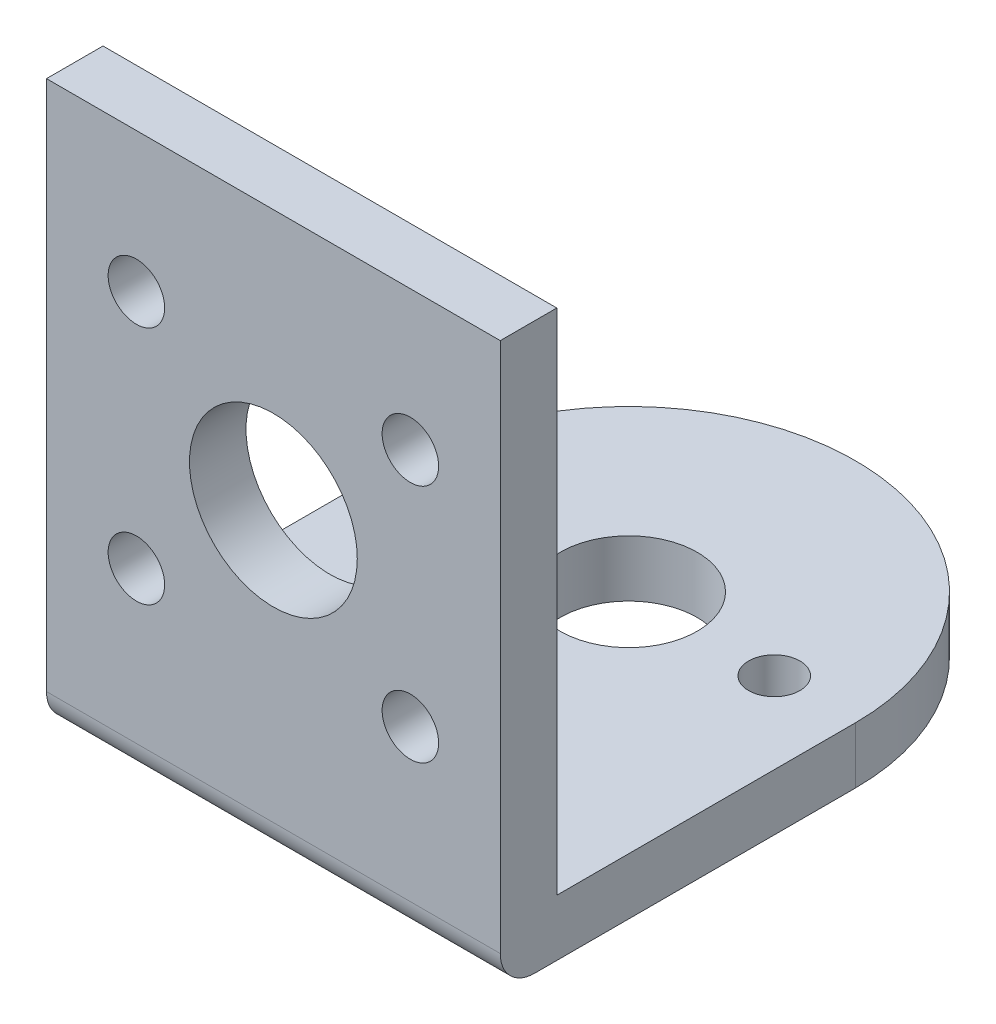
ISO-10303-21;
HEADER;
FILE_DESCRIPTION(('STEP AP214'),'2;1');
FILE_NAME('part.step','',(''),(''),'','','');
FILE_SCHEMA(('AUTOMOTIVE_DESIGN { 1 0 10303 214 1 1 1 1 }'));
ENDSEC;
DATA;
#1=APPLICATION_CONTEXT('core data for automotive mechanical design processes');
#2=APPLICATION_PROTOCOL_DEFINITION('international standard','automotive_design',2000,#1);
#3=PRODUCT_CONTEXT('',#1,'mechanical');
#4=PRODUCT('Part','Part','',(#3));
#5=PRODUCT_RELATED_PRODUCT_CATEGORY('part','',(#4));
#6=PRODUCT_DEFINITION_FORMATION('','',#4);
#7=PRODUCT_DEFINITION_CONTEXT('part definition',#1,'design');
#8=PRODUCT_DEFINITION('design','',#6,#7);
#9=PRODUCT_DEFINITION_SHAPE('','',#8);
#10=(LENGTH_UNIT() NAMED_UNIT(*) SI_UNIT(.MILLI.,.METRE.));
#11=(NAMED_UNIT(*) PLANE_ANGLE_UNIT() SI_UNIT($,.RADIAN.));
#12=(NAMED_UNIT(*) SI_UNIT($,.STERADIAN.) SOLID_ANGLE_UNIT());
#13=UNCERTAINTY_MEASURE_WITH_UNIT(LENGTH_MEASURE(1.E-05),#10,'distance_accuracy_value','');
#14=(GEOMETRIC_REPRESENTATION_CONTEXT(3) GLOBAL_UNCERTAINTY_ASSIGNED_CONTEXT((#13)) GLOBAL_UNIT_ASSIGNED_CONTEXT((#10,
#11,#12)) REPRESENTATION_CONTEXT('',''));
#15=CARTESIAN_POINT('',(0.,0.,0.));
#16=DIRECTION('',(0.,0.,1.));
#17=DIRECTION('',(1.,0.,0.));
#18=AXIS2_PLACEMENT_3D('',#15,#16,#17);
#19=CARTESIAN_POINT('',(0.,3.3,0.));
#20=DIRECTION('',(0.,1.,0.));
#21=DIRECTION('',(0.,0.,1.));
#22=AXIS2_PLACEMENT_3D('',#19,#20,#21);
#23=PLANE('',#22);
#24=DIRECTION('',(-1.,0.,0.));
#25=VECTOR('',#24,1.);
#26=CARTESIAN_POINT('',(0.,3.3,17.45));
#27=LINE('',#26,#25);
#28=CARTESIAN_POINT('',(13.25,3.3,17.45));
#29=VERTEX_POINT('',#28);
#30=CARTESIAN_POINT('',(-13.25,3.3,17.45));
#31=VERTEX_POINT('',#30);
#32=EDGE_CURVE('E171',#29,#31,#27,.T.);
#33=ORIENTED_EDGE('',*,*,#32,.F.);
#34=DIRECTION('',(0.,0.,1.));
#35=VECTOR('',#34,1.);
#36=CARTESIAN_POINT('',(13.25,3.3,0.));
#37=LINE('',#36,#35);
#38=CARTESIAN_POINT('',(13.25,3.3,0.));
#39=VERTEX_POINT('',#38);
#40=EDGE_CURVE('E148',#39,#29,#37,.T.);
#41=ORIENTED_EDGE('',*,*,#40,.F.);
#42=CARTESIAN_POINT('',(0.,3.3,0.));
#43=DIRECTION('',(0.,1.,0.));
#44=DIRECTION('',(0.,0.,1.));
#45=AXIS2_PLACEMENT_3D('',#42,#43,#44);
#46=CIRCLE('',#45,13.25);
#47=CARTESIAN_POINT('',(-13.25,3.3,0.));
#48=VERTEX_POINT('',#47);
#49=EDGE_CURVE('E197',#39,#48,#46,.T.);
#50=ORIENTED_EDGE('',*,*,#49,.T.);
#51=DIRECTION('',(0.,0.,1.));
#52=VECTOR('',#51,1.);
#53=CARTESIAN_POINT('',(-13.25,3.3,0.));
#54=LINE('',#53,#52);
#55=EDGE_CURVE('E193',#48,#31,#54,.T.);
#56=ORIENTED_EDGE('',*,*,#55,.T.);
#57=EDGE_LOOP('',(#33,#41,#50,#56));
#58=FACE_BOUND('',#57,.T.);
#59=CARTESIAN_POINT('',(0.,3.3,0.));
#60=DIRECTION('',(0.,1.,0.));
#61=DIRECTION('',(0.,0.,1.));
#62=AXIS2_PLACEMENT_3D('',#59,#60,#61);
#63=CIRCLE('',#62,4.);
#64=CARTESIAN_POINT('',(0.,3.3,4.));
#65=VERTEX_POINT('',#64);
#66=EDGE_CURVE('E181',#65,#65,#63,.T.);
#67=ORIENTED_EDGE('',*,*,#66,.F.);
#68=EDGE_LOOP('',(#67));
#69=FACE_BOUND('',#68,.T.);
#70=CARTESIAN_POINT('',(-8.5,3.3,0.));
#71=DIRECTION('',(0.,1.,0.));
#72=DIRECTION('',(0.,0.,1.));
#73=AXIS2_PLACEMENT_3D('',#70,#71,#72);
#74=CIRCLE('',#73,1.5);
#75=CARTESIAN_POINT('',(-8.5,3.3,1.5));
#76=VERTEX_POINT('',#75);
#77=EDGE_CURVE('E187',#76,#76,#74,.T.);
#78=ORIENTED_EDGE('',*,*,#77,.F.);
#79=EDGE_LOOP('',(#78));
#80=FACE_BOUND('',#79,.T.);
#81=CARTESIAN_POINT('',(8.5,3.3,0.));
#82=DIRECTION('',(0.,1.,0.));
#83=DIRECTION('',(0.,0.,1.));
#84=AXIS2_PLACEMENT_3D('',#81,#82,#83);
#85=CIRCLE('',#84,1.5);
#86=CARTESIAN_POINT('',(8.5,3.3,1.5));
#87=VERTEX_POINT('',#86);
#88=EDGE_CURVE('E175',#87,#87,#85,.T.);
#89=ORIENTED_EDGE('',*,*,#88,.F.);
#90=EDGE_LOOP('',(#89));
#91=FACE_BOUND('',#90,.T.);
#92=ADVANCED_FACE('F83',(#58,#69,#80,#91),#23,.T.);
#93=CARTESIAN_POINT('',(0.,0.,0.));
#94=DIRECTION('',(0.,1.,0.));
#95=DIRECTION('',(0.,0.,1.));
#96=AXIS2_PLACEMENT_3D('',#93,#94,#95);
#97=PLANE('',#96);
#98=DIRECTION('',(0.,0.,1.));
#99=VECTOR('',#98,1.);
#100=CARTESIAN_POINT('',(13.25,0.,0.));
#101=LINE('',#100,#99);
#102=CARTESIAN_POINT('',(13.25,0.,0.));
#103=VERTEX_POINT('',#102);
#104=CARTESIAN_POINT('',(13.25,0.,18.75));
#105=VERTEX_POINT('',#104);
#106=EDGE_CURVE('E201',#103,#105,#101,.T.);
#107=ORIENTED_EDGE('',*,*,#106,.T.);
#108=DIRECTION('',(1.,0.,0.));
#109=VECTOR('',#108,1.);
#110=CARTESIAN_POINT('',(0.,0.,18.75));
#111=LINE('',#110,#109);
#112=CARTESIAN_POINT('',(-13.25,0.,18.75));
#113=VERTEX_POINT('',#112);
#114=EDGE_CURVE('E91',#105,#113,#111,.F.);
#115=ORIENTED_EDGE('',*,*,#114,.T.);
#116=DIRECTION('',(0.,0.,1.));
#117=VECTOR('',#116,1.);
#118=CARTESIAN_POINT('',(-13.25,0.,0.));
#119=LINE('',#118,#117);
#120=CARTESIAN_POINT('',(-13.25,0.,0.));
#121=VERTEX_POINT('',#120);
#122=EDGE_CURVE('E190',#121,#113,#119,.T.);
#123=ORIENTED_EDGE('',*,*,#122,.F.);
#124=CARTESIAN_POINT('',(0.,0.,0.));
#125=DIRECTION('',(0.,1.,0.));
#126=DIRECTION('',(0.,0.,1.));
#127=AXIS2_PLACEMENT_3D('',#124,#125,#126);
#128=CIRCLE('',#127,13.25);
#129=EDGE_CURVE('E195',#103,#121,#128,.T.);
#130=ORIENTED_EDGE('',*,*,#129,.F.);
#131=EDGE_LOOP('',(#107,#115,#123,#130));
#132=FACE_BOUND('',#131,.T.);
#133=CARTESIAN_POINT('',(-8.5,0.,0.));
#134=DIRECTION('',(0.,1.,0.));
#135=DIRECTION('',(0.,0.,1.));
#136=AXIS2_PLACEMENT_3D('',#133,#134,#135);
#137=CIRCLE('',#136,1.5);
#138=CARTESIAN_POINT('',(-8.5,0.,1.5));
#139=VERTEX_POINT('',#138);
#140=EDGE_CURVE('E184',#139,#139,#137,.T.);
#141=ORIENTED_EDGE('',*,*,#140,.T.);
#142=EDGE_LOOP('',(#141));
#143=FACE_BOUND('',#142,.T.);
#144=CARTESIAN_POINT('',(0.,0.,0.));
#145=DIRECTION('',(0.,1.,0.));
#146=DIRECTION('',(0.,0.,1.));
#147=AXIS2_PLACEMENT_3D('',#144,#145,#146);
#148=CIRCLE('',#147,4.);
#149=CARTESIAN_POINT('',(0.,0.,4.));
#150=VERTEX_POINT('',#149);
#151=EDGE_CURVE('E178',#150,#150,#148,.T.);
#152=ORIENTED_EDGE('',*,*,#151,.T.);
#153=EDGE_LOOP('',(#152));
#154=FACE_BOUND('',#153,.T.);
#155=CARTESIAN_POINT('',(8.5,0.,0.));
#156=DIRECTION('',(0.,1.,0.));
#157=DIRECTION('',(0.,0.,1.));
#158=AXIS2_PLACEMENT_3D('',#155,#156,#157);
#159=CIRCLE('',#158,1.5);
#160=CARTESIAN_POINT('',(8.5,0.,1.5));
#161=VERTEX_POINT('',#160);
#162=EDGE_CURVE('E174',#161,#161,#159,.T.);
#163=ORIENTED_EDGE('',*,*,#162,.T.);
#164=EDGE_LOOP('',(#163));
#165=FACE_BOUND('',#164,.T.);
#166=ADVANCED_FACE('F227',(#132,#143,#154,#165),#97,.F.);
#167=CARTESIAN_POINT('',(-13.25,3.3,0.));
#168=DIRECTION('',(1.,0.,0.));
#169=DIRECTION('',(0.,0.,-1.));
#170=AXIS2_PLACEMENT_3D('',#167,#168,#169);
#171=PLANE('',#170);
#172=ORIENTED_EDGE('',*,*,#122,.T.);
#173=CARTESIAN_POINT('',(-13.25,2.,18.75));
#174=DIRECTION('',(1.,0.,0.));
#175=DIRECTION('',(0.,0.,-1.));
#176=AXIS2_PLACEMENT_3D('',#173,#174,#175);
#177=CIRCLE('',#176,2.);
#178=CARTESIAN_POINT('',(-13.25,2.,20.75));
#179=VERTEX_POINT('',#178);
#180=EDGE_CURVE('E12',#113,#179,#177,.F.);
#181=ORIENTED_EDGE('',*,*,#180,.T.);
#182=DIRECTION('',(0.,-1.,0.));
#183=VECTOR('',#182,1.);
#184=CARTESIAN_POINT('',(-13.25,3.3,20.75));
#185=LINE('',#184,#183);
#186=CARTESIAN_POINT('',(-13.25,33.,20.75));
#187=VERTEX_POINT('',#186);
#188=EDGE_CURVE('E210',#187,#179,#185,.T.);
#189=ORIENTED_EDGE('',*,*,#188,.F.);
#190=DIRECTION('',(0.,0.,1.));
#191=VECTOR('',#190,1.);
#192=CARTESIAN_POINT('',(-13.25,33.,17.45));
#193=LINE('',#192,#191);
#194=CARTESIAN_POINT('',(-13.25,33.,17.45));
#195=VERTEX_POINT('',#194);
#196=EDGE_CURVE('E161',#195,#187,#193,.T.);
#197=ORIENTED_EDGE('',*,*,#196,.F.);
#198=DIRECTION('',(0.,-1.,0.));
#199=VECTOR('',#198,1.);
#200=CARTESIAN_POINT('',(-13.25,0.,17.45));
#201=LINE('',#200,#199);
#202=EDGE_CURVE('E153',#195,#31,#201,.T.);
#203=ORIENTED_EDGE('',*,*,#202,.T.);
#204=ORIENTED_EDGE('',*,*,#55,.F.);
#205=DIRECTION('',(0.,-1.,0.));
#206=VECTOR('',#205,1.);
#207=CARTESIAN_POINT('',(-13.25,3.3,0.));
#208=LINE('',#207,#206);
#209=EDGE_CURVE('E199',#48,#121,#208,.T.);
#210=ORIENTED_EDGE('',*,*,#209,.T.);
#211=EDGE_LOOP('',(#172,#181,#189,#197,#203,#204,#210));
#212=FACE_BOUND('',#211,.T.);
#213=ADVANCED_FACE('F223',(#212),#171,.F.);
#214=CARTESIAN_POINT('',(-13.25,3.3,20.75));
#215=DIRECTION('',(0.,0.,-1.));
#216=DIRECTION('',(-1.,0.,0.));
#217=AXIS2_PLACEMENT_3D('',#214,#215,#216);
#218=PLANE('',#217);
#219=ORIENTED_EDGE('',*,*,#188,.T.);
#220=DIRECTION('',(1.,0.,0.));
#221=VECTOR('',#220,1.);
#222=CARTESIAN_POINT('',(-13.25,2.,20.75));
#223=LINE('',#222,#221);
#224=CARTESIAN_POINT('',(13.25,2.,20.75));
#225=VERTEX_POINT('',#224);
#226=EDGE_CURVE('E213',#179,#225,#223,.T.);
#227=ORIENTED_EDGE('',*,*,#226,.T.);
#228=DIRECTION('',(0.,-1.,0.));
#229=VECTOR('',#228,1.);
#230=CARTESIAN_POINT('',(13.25,3.3,20.75));
#231=LINE('',#230,#229);
#232=CARTESIAN_POINT('',(13.25,33.,20.75));
#233=VERTEX_POINT('',#232);
#234=EDGE_CURVE('E208',#233,#225,#231,.T.);
#235=ORIENTED_EDGE('',*,*,#234,.F.);
#236=DIRECTION('',(-1.,0.,0.));
#237=VECTOR('',#236,1.);
#238=CARTESIAN_POINT('',(-13.25,33.,20.75));
#239=LINE('',#238,#237);
#240=EDGE_CURVE('E160',#233,#187,#239,.T.);
#241=ORIENTED_EDGE('',*,*,#240,.T.);
#242=EDGE_LOOP('',(#219,#227,#235,#241));
#243=FACE_BOUND('',#242,.T.);
#244=CARTESIAN_POINT('',(-7.99999999999999,24.85,20.75));
#245=DIRECTION('',(0.,0.,1.));
#246=DIRECTION('',(1.,0.,0.));
#247=AXIS2_PLACEMENT_3D('',#244,#245,#246);
#248=CIRCLE('',#247,1.65);
#249=CARTESIAN_POINT('',(-6.35,24.85,20.75));
#250=VERTEX_POINT('',#249);
#251=EDGE_CURVE('E259',#250,#250,#248,.T.);
#252=ORIENTED_EDGE('',*,*,#251,.F.);
#253=EDGE_LOOP('',(#252));
#254=FACE_BOUND('',#253,.T.);
#255=CARTESIAN_POINT('',(-7.99999999999999,10.85,20.75));
#256=DIRECTION('',(0.,0.,1.));
#257=DIRECTION('',(1.,0.,0.));
#258=AXIS2_PLACEMENT_3D('',#255,#256,#257);
#259=CIRCLE('',#258,1.65);
#260=CARTESIAN_POINT('',(-6.35,10.85,20.75));
#261=VERTEX_POINT('',#260);
#262=EDGE_CURVE('E253',#261,#261,#259,.T.);
#263=ORIENTED_EDGE('',*,*,#262,.F.);
#264=EDGE_LOOP('',(#263));
#265=FACE_BOUND('',#264,.T.);
#266=CARTESIAN_POINT('',(8.00000000000001,24.85,20.75));
#267=DIRECTION('',(0.,0.,1.));
#268=DIRECTION('',(1.,0.,0.));
#269=AXIS2_PLACEMENT_3D('',#266,#267,#268);
#270=CIRCLE('',#269,1.65);
#271=CARTESIAN_POINT('',(9.65,24.85,20.75));
#272=VERTEX_POINT('',#271);
#273=EDGE_CURVE('E247',#272,#272,#270,.T.);
#274=ORIENTED_EDGE('',*,*,#273,.F.);
#275=EDGE_LOOP('',(#274));
#276=FACE_BOUND('',#275,.T.);
#277=CARTESIAN_POINT('',(8.00000000000001,10.85,20.75));
#278=DIRECTION('',(0.,0.,1.));
#279=DIRECTION('',(1.,0.,0.));
#280=AXIS2_PLACEMENT_3D('',#277,#278,#279);
#281=CIRCLE('',#280,1.65);
#282=CARTESIAN_POINT('',(9.65,10.85,20.75));
#283=VERTEX_POINT('',#282);
#284=EDGE_CURVE('E241',#283,#283,#281,.T.);
#285=ORIENTED_EDGE('',*,*,#284,.F.);
#286=EDGE_LOOP('',(#285));
#287=FACE_BOUND('',#286,.T.);
#288=CARTESIAN_POINT('',(0.,17.8,20.75));
#289=DIRECTION('',(0.,0.,1.));
#290=DIRECTION('',(1.,0.,0.));
#291=AXIS2_PLACEMENT_3D('',#288,#289,#290);
#292=CIRCLE('',#291,4.9);
#293=CARTESIAN_POINT('',(4.90000000000001,17.8,20.75));
#294=VERTEX_POINT('',#293);
#295=EDGE_CURVE('E235',#294,#294,#292,.T.);
#296=ORIENTED_EDGE('',*,*,#295,.F.);
#297=EDGE_LOOP('',(#296));
#298=FACE_BOUND('',#297,.T.);
#299=ADVANCED_FACE('F218',(#243,#254,#265,#276,#287,#298),#218,.F.);
#300=CARTESIAN_POINT('',(13.25,3.3,0.));
#301=DIRECTION('',(1.,0.,0.));
#302=DIRECTION('',(0.,0.,-1.));
#303=AXIS2_PLACEMENT_3D('',#300,#301,#302);
#304=PLANE('',#303);
#305=ORIENTED_EDGE('',*,*,#234,.T.);
#306=CARTESIAN_POINT('',(13.25,2.,18.75));
#307=DIRECTION('',(1.,0.,0.));
#308=DIRECTION('',(0.,0.,-1.));
#309=AXIS2_PLACEMENT_3D('',#306,#307,#308);
#310=CIRCLE('',#309,2.);
#311=EDGE_CURVE('E105',#225,#105,#310,.T.);
#312=ORIENTED_EDGE('',*,*,#311,.T.);
#313=ORIENTED_EDGE('',*,*,#106,.F.);
#314=DIRECTION('',(0.,-1.,0.));
#315=VECTOR('',#314,1.);
#316=CARTESIAN_POINT('',(13.25,3.3,0.));
#317=LINE('',#316,#315);
#318=EDGE_CURVE('E206',#39,#103,#317,.T.);
#319=ORIENTED_EDGE('',*,*,#318,.F.);
#320=ORIENTED_EDGE('',*,*,#40,.T.);
#321=DIRECTION('',(0.,1.,0.));
#322=VECTOR('',#321,1.);
#323=CARTESIAN_POINT('',(13.25,0.,17.45));
#324=LINE('',#323,#322);
#325=CARTESIAN_POINT('',(13.25,33.,17.45));
#326=VERTEX_POINT('',#325);
#327=EDGE_CURVE('E142',#29,#326,#324,.T.);
#328=ORIENTED_EDGE('',*,*,#327,.T.);
#329=DIRECTION('',(0.,0.,1.));
#330=VECTOR('',#329,1.);
#331=CARTESIAN_POINT('',(13.25,33.,17.45));
#332=LINE('',#331,#330);
#333=EDGE_CURVE('E145',#326,#233,#332,.T.);
#334=ORIENTED_EDGE('',*,*,#333,.T.);
#335=EDGE_LOOP('',(#305,#312,#313,#319,#320,#328,#334));
#336=FACE_BOUND('',#335,.T.);
#337=ADVANCED_FACE('F144',(#336),#304,.T.);
#338=CARTESIAN_POINT('',(0.,3.3,0.));
#339=DIRECTION('',(0.,-1.,0.));
#340=DIRECTION('',(0.,0.,-1.));
#341=AXIS2_PLACEMENT_3D('',#338,#339,#340);
#342=CYLINDRICAL_SURFACE('',#341,13.25);
#343=ORIENTED_EDGE('',*,*,#129,.T.);
#344=ORIENTED_EDGE('',*,*,#209,.F.);
#345=ORIENTED_EDGE('',*,*,#49,.F.);
#346=ORIENTED_EDGE('',*,*,#318,.T.);
#347=EDGE_LOOP('',(#343,#344,#345,#346));
#348=FACE_BOUND('',#347,.T.);
#349=ADVANCED_FACE('F231',(#348),#342,.T.);
#350=CARTESIAN_POINT('',(-8.5,3.3,0.));
#351=DIRECTION('',(0.,-1.,0.));
#352=DIRECTION('',(0.,0.,-1.));
#353=AXIS2_PLACEMENT_3D('',#350,#351,#352);
#354=CYLINDRICAL_SURFACE('',#353,1.5);
#355=ORIENTED_EDGE('',*,*,#77,.T.);
#356=EDGE_LOOP('',(#355));
#357=FACE_BOUND('',#356,.T.);
#358=ORIENTED_EDGE('',*,*,#140,.F.);
#359=EDGE_LOOP('',(#358));
#360=FACE_BOUND('',#359,.T.);
#361=ADVANCED_FACE('F307',(#357,#360),#354,.F.);
#362=CARTESIAN_POINT('',(0.,3.3,0.));
#363=DIRECTION('',(0.,-1.,0.));
#364=DIRECTION('',(0.,0.,-1.));
#365=AXIS2_PLACEMENT_3D('',#362,#363,#364);
#366=CYLINDRICAL_SURFACE('',#365,4.);
#367=ORIENTED_EDGE('',*,*,#66,.T.);
#368=EDGE_LOOP('',(#367));
#369=FACE_BOUND('',#368,.T.);
#370=ORIENTED_EDGE('',*,*,#151,.F.);
#371=EDGE_LOOP('',(#370));
#372=FACE_BOUND('',#371,.T.);
#373=ADVANCED_FACE('F390',(#369,#372),#366,.F.);
#374=CARTESIAN_POINT('',(8.5,3.3,0.));
#375=DIRECTION('',(0.,-1.,0.));
#376=DIRECTION('',(0.,0.,-1.));
#377=AXIS2_PLACEMENT_3D('',#374,#375,#376);
#378=CYLINDRICAL_SURFACE('',#377,1.5);
#379=ORIENTED_EDGE('',*,*,#88,.T.);
#380=EDGE_LOOP('',(#379));
#381=FACE_BOUND('',#380,.T.);
#382=ORIENTED_EDGE('',*,*,#162,.F.);
#383=EDGE_LOOP('',(#382));
#384=FACE_BOUND('',#383,.T.);
#385=ADVANCED_FACE('F383',(#381,#384),#378,.F.);
#386=CARTESIAN_POINT('',(-13.25,33.,17.45));
#387=DIRECTION('',(0.,1.,0.));
#388=DIRECTION('',(0.,0.,1.));
#389=AXIS2_PLACEMENT_3D('',#386,#387,#388);
#390=PLANE('',#389);
#391=ORIENTED_EDGE('',*,*,#240,.F.);
#392=ORIENTED_EDGE('',*,*,#333,.F.);
#393=DIRECTION('',(-1.,0.,0.));
#394=VECTOR('',#393,1.);
#395=CARTESIAN_POINT('',(-13.25,33.,17.45));
#396=LINE('',#395,#394);
#397=EDGE_CURVE('E152',#326,#195,#396,.T.);
#398=ORIENTED_EDGE('',*,*,#397,.T.);
#399=ORIENTED_EDGE('',*,*,#196,.T.);
#400=EDGE_LOOP('',(#391,#392,#398,#399));
#401=FACE_BOUND('',#400,.T.);
#402=ADVANCED_FACE('F157',(#401),#390,.T.);
#403=CARTESIAN_POINT('',(0.,0.,17.45));
#404=DIRECTION('',(0.,0.,-1.));
#405=DIRECTION('',(-1.,0.,0.));
#406=AXIS2_PLACEMENT_3D('',#403,#404,#405);
#407=PLANE('',#406);
#408=CARTESIAN_POINT('',(-7.99999999999999,24.85,17.45));
#409=DIRECTION('',(0.,0.,1.));
#410=DIRECTION('',(1.,0.,0.));
#411=AXIS2_PLACEMENT_3D('',#408,#409,#410);
#412=CIRCLE('',#411,1.65);
#413=CARTESIAN_POINT('',(-6.35,24.85,17.45));
#414=VERTEX_POINT('',#413);
#415=EDGE_CURVE('E256',#414,#414,#412,.T.);
#416=ORIENTED_EDGE('',*,*,#415,.T.);
#417=EDGE_LOOP('',(#416));
#418=FACE_BOUND('',#417,.T.);
#419=CARTESIAN_POINT('',(-7.99999999999999,10.85,17.45));
#420=DIRECTION('',(0.,0.,1.));
#421=DIRECTION('',(1.,0.,0.));
#422=AXIS2_PLACEMENT_3D('',#419,#420,#421);
#423=CIRCLE('',#422,1.65);
#424=CARTESIAN_POINT('',(-6.35,10.85,17.45));
#425=VERTEX_POINT('',#424);
#426=EDGE_CURVE('E250',#425,#425,#423,.T.);
#427=ORIENTED_EDGE('',*,*,#426,.T.);
#428=EDGE_LOOP('',(#427));
#429=FACE_BOUND('',#428,.T.);
#430=CARTESIAN_POINT('',(8.00000000000001,24.85,17.45));
#431=DIRECTION('',(0.,0.,1.));
#432=DIRECTION('',(1.,0.,0.));
#433=AXIS2_PLACEMENT_3D('',#430,#431,#432);
#434=CIRCLE('',#433,1.65);
#435=CARTESIAN_POINT('',(9.65,24.85,17.45));
#436=VERTEX_POINT('',#435);
#437=EDGE_CURVE('E244',#436,#436,#434,.T.);
#438=ORIENTED_EDGE('',*,*,#437,.T.);
#439=EDGE_LOOP('',(#438));
#440=FACE_BOUND('',#439,.T.);
#441=CARTESIAN_POINT('',(8.00000000000001,10.85,17.45));
#442=DIRECTION('',(0.,0.,1.));
#443=DIRECTION('',(1.,0.,0.));
#444=AXIS2_PLACEMENT_3D('',#441,#442,#443);
#445=CIRCLE('',#444,1.65);
#446=CARTESIAN_POINT('',(9.65,10.85,17.45));
#447=VERTEX_POINT('',#446);
#448=EDGE_CURVE('E238',#447,#447,#445,.T.);
#449=ORIENTED_EDGE('',*,*,#448,.T.);
#450=EDGE_LOOP('',(#449));
#451=FACE_BOUND('',#450,.T.);
#452=CARTESIAN_POINT('',(0.,17.8,17.45));
#453=DIRECTION('',(0.,0.,1.));
#454=DIRECTION('',(1.,0.,0.));
#455=AXIS2_PLACEMENT_3D('',#452,#453,#454);
#456=CIRCLE('',#455,4.9);
#457=CARTESIAN_POINT('',(4.90000000000001,17.8,17.45));
#458=VERTEX_POINT('',#457);
#459=EDGE_CURVE('E170',#458,#458,#456,.T.);
#460=ORIENTED_EDGE('',*,*,#459,.T.);
#461=EDGE_LOOP('',(#460));
#462=FACE_BOUND('',#461,.T.);
#463=ORIENTED_EDGE('',*,*,#327,.F.);
#464=ORIENTED_EDGE('',*,*,#32,.T.);
#465=ORIENTED_EDGE('',*,*,#202,.F.);
#466=ORIENTED_EDGE('',*,*,#397,.F.);
#467=EDGE_LOOP('',(#463,#464,#465,#466));
#468=FACE_BOUND('',#467,.T.);
#469=ADVANCED_FACE('F164',(#418,#429,#440,#451,#462,#468),#407,.T.);
#470=CARTESIAN_POINT('',(0.,17.8,17.45));
#471=DIRECTION('',(0.,0.,1.));
#472=DIRECTION('',(1.,0.,0.));
#473=AXIS2_PLACEMENT_3D('',#470,#471,#472);
#474=CYLINDRICAL_SURFACE('',#473,4.9);
#475=ORIENTED_EDGE('',*,*,#459,.F.);
#476=EDGE_LOOP('',(#475));
#477=FACE_BOUND('',#476,.T.);
#478=ORIENTED_EDGE('',*,*,#295,.T.);
#479=EDGE_LOOP('',(#478));
#480=FACE_BOUND('',#479,.T.);
#481=ADVANCED_FACE('F284',(#477,#480),#474,.F.);
#482=CARTESIAN_POINT('',(8.00000000000001,10.85,17.45));
#483=DIRECTION('',(0.,0.,1.));
#484=DIRECTION('',(1.,0.,0.));
#485=AXIS2_PLACEMENT_3D('',#482,#483,#484);
#486=CYLINDRICAL_SURFACE('',#485,1.65);
#487=ORIENTED_EDGE('',*,*,#448,.F.);
#488=EDGE_LOOP('',(#487));
#489=FACE_BOUND('',#488,.T.);
#490=ORIENTED_EDGE('',*,*,#284,.T.);
#491=EDGE_LOOP('',(#490));
#492=FACE_BOUND('',#491,.T.);
#493=ADVANCED_FACE('F286',(#489,#492),#486,.F.);
#494=CARTESIAN_POINT('',(8.00000000000001,24.85,17.45));
#495=DIRECTION('',(0.,0.,1.));
#496=DIRECTION('',(1.,0.,0.));
#497=AXIS2_PLACEMENT_3D('',#494,#495,#496);
#498=CYLINDRICAL_SURFACE('',#497,1.65);
#499=ORIENTED_EDGE('',*,*,#437,.F.);
#500=EDGE_LOOP('',(#499));
#501=FACE_BOUND('',#500,.T.);
#502=ORIENTED_EDGE('',*,*,#273,.T.);
#503=EDGE_LOOP('',(#502));
#504=FACE_BOUND('',#503,.T.);
#505=ADVANCED_FACE('F293',(#501,#504),#498,.F.);
#506=CARTESIAN_POINT('',(-7.99999999999999,10.85,17.45));
#507=DIRECTION('',(0.,0.,1.));
#508=DIRECTION('',(1.,0.,0.));
#509=AXIS2_PLACEMENT_3D('',#506,#507,#508);
#510=CYLINDRICAL_SURFACE('',#509,1.65);
#511=ORIENTED_EDGE('',*,*,#426,.F.);
#512=EDGE_LOOP('',(#511));
#513=FACE_BOUND('',#512,.T.);
#514=ORIENTED_EDGE('',*,*,#262,.T.);
#515=EDGE_LOOP('',(#514));
#516=FACE_BOUND('',#515,.T.);
#517=ADVANCED_FACE('F270',(#513,#516),#510,.F.);
#518=CARTESIAN_POINT('',(-7.99999999999999,24.85,17.45));
#519=DIRECTION('',(0.,0.,1.));
#520=DIRECTION('',(1.,0.,0.));
#521=AXIS2_PLACEMENT_3D('',#518,#519,#520);
#522=CYLINDRICAL_SURFACE('',#521,1.65);
#523=ORIENTED_EDGE('',*,*,#415,.F.);
#524=EDGE_LOOP('',(#523));
#525=FACE_BOUND('',#524,.T.);
#526=ORIENTED_EDGE('',*,*,#251,.T.);
#527=EDGE_LOOP('',(#526));
#528=FACE_BOUND('',#527,.T.);
#529=ADVANCED_FACE('F267',(#525,#528),#522,.F.);
#530=CARTESIAN_POINT('',(-13.25,2.,18.75));
#531=DIRECTION('',(1.,0.,0.));
#532=DIRECTION('',(0.,0.,-1.));
#533=AXIS2_PLACEMENT_3D('',#530,#531,#532);
#534=CYLINDRICAL_SURFACE('',#533,2.);
#535=ORIENTED_EDGE('',*,*,#180,.F.);
#536=ORIENTED_EDGE('',*,*,#114,.F.);
#537=ORIENTED_EDGE('',*,*,#311,.F.);
#538=ORIENTED_EDGE('',*,*,#226,.F.);
#539=EDGE_LOOP('',(#535,#536,#537,#538));
#540=FACE_BOUND('',#539,.T.);
#541=ADVANCED_FACE('F85',(#540),#534,.T.);
#542=CLOSED_SHELL('',(#92,#166,#213,#299,#337,#349,#361,#373,#385,#402,#469,#481,#493,#505,#517,
#529,#541));
#543=MANIFOLD_SOLID_BREP('B2',#542);
#544=ADVANCED_BREP_SHAPE_REPRESENTATION('',(#18,#543),#14);
#545=SHAPE_DEFINITION_REPRESENTATION(#9,#544);
ENDSEC;
END-ISO-10303-21;
